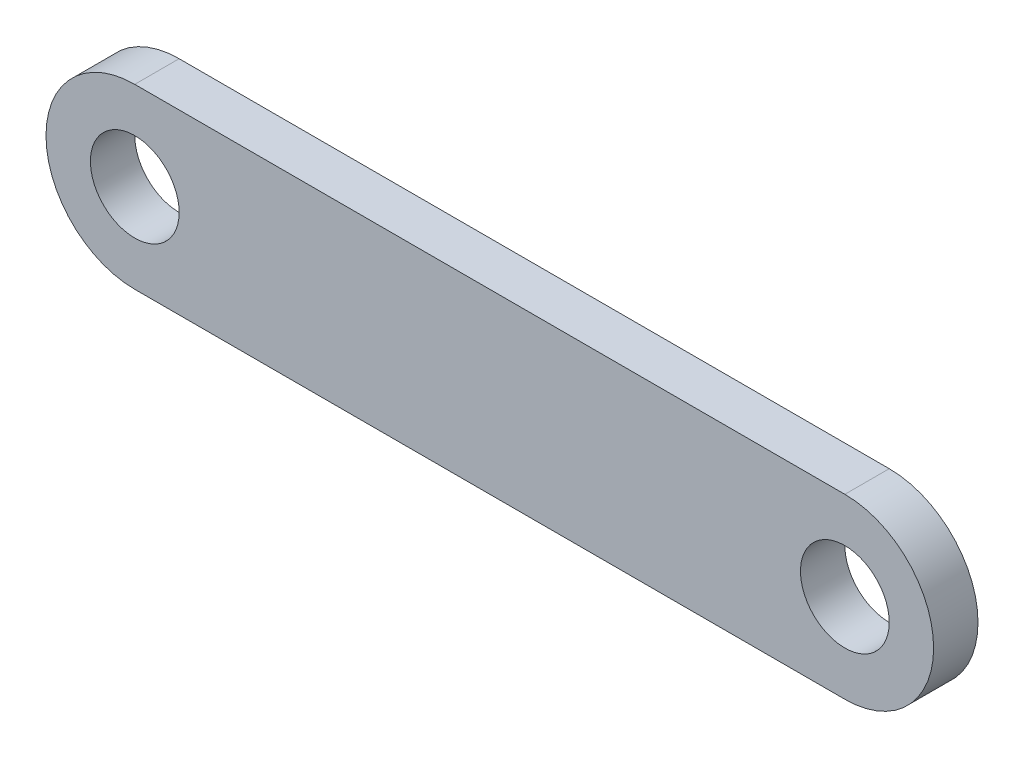
ISO-10303-21;
HEADER;
FILE_DESCRIPTION(('STEP AP214'),'2;1');
FILE_NAME('part.step','',(''),(''),'','','');
FILE_SCHEMA(('AUTOMOTIVE_DESIGN { 1 0 10303 214 1 1 1 1 }'));
ENDSEC;
DATA;
#1=APPLICATION_CONTEXT('core data for automotive mechanical design processes');
#2=APPLICATION_PROTOCOL_DEFINITION('international standard','automotive_design',2000,#1);
#3=PRODUCT_CONTEXT('',#1,'mechanical');
#4=PRODUCT('Part','Part','',(#3));
#5=PRODUCT_RELATED_PRODUCT_CATEGORY('part','',(#4));
#6=PRODUCT_DEFINITION_FORMATION('','',#4);
#7=PRODUCT_DEFINITION_CONTEXT('part definition',#1,'design');
#8=PRODUCT_DEFINITION('design','',#6,#7);
#9=PRODUCT_DEFINITION_SHAPE('','',#8);
#10=(LENGTH_UNIT() NAMED_UNIT(*) SI_UNIT(.MILLI.,.METRE.));
#11=(NAMED_UNIT(*) PLANE_ANGLE_UNIT() SI_UNIT($,.RADIAN.));
#12=(NAMED_UNIT(*) SI_UNIT($,.STERADIAN.) SOLID_ANGLE_UNIT());
#13=UNCERTAINTY_MEASURE_WITH_UNIT(LENGTH_MEASURE(1.E-05),#10,'distance_accuracy_value','');
#14=(GEOMETRIC_REPRESENTATION_CONTEXT(3) GLOBAL_UNCERTAINTY_ASSIGNED_CONTEXT((#13)) GLOBAL_UNIT_ASSIGNED_CONTEXT((#10,
#11,#12)) REPRESENTATION_CONTEXT('',''));
#15=CARTESIAN_POINT('',(0.,0.,0.));
#16=DIRECTION('',(0.,0.,1.));
#17=DIRECTION('',(1.,0.,0.));
#18=AXIS2_PLACEMENT_3D('',#15,#16,#17);
#19=CARTESIAN_POINT('',(0.,0.,3.175));
#20=DIRECTION('',(0.,0.,1.));
#21=DIRECTION('',(1.,0.,0.));
#22=AXIS2_PLACEMENT_3D('',#19,#20,#21);
#23=PLANE('',#22);
#24=CARTESIAN_POINT('',(0.,0.,3.175));
#25=DIRECTION('',(0.,0.,1.));
#26=DIRECTION('',(1.,0.,0.));
#27=AXIS2_PLACEMENT_3D('',#24,#25,#26);
#28=CIRCLE('',#27,3.175);
#29=CARTESIAN_POINT('',(3.175,0.,3.175));
#30=VERTEX_POINT('',#29);
#31=EDGE_CURVE('E99',#30,#30,#28,.T.);
#32=ORIENTED_EDGE('',*,*,#31,.F.);
#33=EDGE_LOOP('',(#32));
#34=FACE_BOUND('',#33,.T.);
#35=CARTESIAN_POINT('',(0.,0.,3.175));
#36=DIRECTION('',(0.,0.,1.));
#37=DIRECTION('',(1.,0.,0.));
#38=AXIS2_PLACEMENT_3D('',#35,#36,#37);
#39=CIRCLE('',#38,6.35);
#40=CARTESIAN_POINT('',(0.,6.35,3.175));
#41=VERTEX_POINT('',#40);
#42=CARTESIAN_POINT('',(0.,-6.35,3.175));
#43=VERTEX_POINT('',#42);
#44=EDGE_CURVE('E84',#41,#43,#39,.T.);
#45=ORIENTED_EDGE('',*,*,#44,.T.);
#46=DIRECTION('',(1.,0.,0.));
#47=VECTOR('',#46,1.);
#48=CARTESIAN_POINT('',(0.,-6.35,3.175));
#49=LINE('',#48,#47);
#50=CARTESIAN_POINT('',(50.8,-6.35,3.175));
#51=VERTEX_POINT('',#50);
#52=EDGE_CURVE('E79',#43,#51,#49,.T.);
#53=ORIENTED_EDGE('',*,*,#52,.T.);
#54=CARTESIAN_POINT('',(50.8,0.,3.175));
#55=DIRECTION('',(0.,0.,1.));
#56=DIRECTION('',(1.,0.,0.));
#57=AXIS2_PLACEMENT_3D('',#54,#55,#56);
#58=CIRCLE('',#57,6.35);
#59=CARTESIAN_POINT('',(50.8,6.35,3.175));
#60=VERTEX_POINT('',#59);
#61=EDGE_CURVE('E82',#51,#60,#58,.T.);
#62=ORIENTED_EDGE('',*,*,#61,.T.);
#63=DIRECTION('',(-1.,0.,0.));
#64=VECTOR('',#63,1.);
#65=CARTESIAN_POINT('',(0.,6.35,3.175));
#66=LINE('',#65,#64);
#67=EDGE_CURVE('E49',#60,#41,#66,.T.);
#68=ORIENTED_EDGE('',*,*,#67,.T.);
#69=EDGE_LOOP('',(#45,#53,#62,#68));
#70=FACE_BOUND('',#69,.T.);
#71=CARTESIAN_POINT('',(50.8,0.,3.175));
#72=DIRECTION('',(0.,0.,1.));
#73=DIRECTION('',(1.,0.,0.));
#74=AXIS2_PLACEMENT_3D('',#71,#72,#73);
#75=CIRCLE('',#74,3.175);
#76=CARTESIAN_POINT('',(53.975,0.,3.175));
#77=VERTEX_POINT('',#76);
#78=EDGE_CURVE('E114',#77,#77,#75,.T.);
#79=ORIENTED_EDGE('',*,*,#78,.F.);
#80=EDGE_LOOP('',(#79));
#81=FACE_BOUND('',#80,.T.);
#82=ADVANCED_FACE('F32',(#34,#70,#81),#23,.T.);
#83=CARTESIAN_POINT('',(0.,0.,0.));
#84=DIRECTION('',(0.,0.,1.));
#85=DIRECTION('',(1.,0.,0.));
#86=AXIS2_PLACEMENT_3D('',#83,#84,#85);
#87=PLANE('',#86);
#88=CARTESIAN_POINT('',(0.,0.,0.));
#89=DIRECTION('',(0.,0.,1.));
#90=DIRECTION('',(1.,0.,0.));
#91=AXIS2_PLACEMENT_3D('',#88,#89,#90);
#92=CIRCLE('',#91,3.175);
#93=CARTESIAN_POINT('',(3.175,0.,0.));
#94=VERTEX_POINT('',#93);
#95=EDGE_CURVE('E111',#94,#94,#92,.T.);
#96=ORIENTED_EDGE('',*,*,#95,.T.);
#97=EDGE_LOOP('',(#96));
#98=FACE_BOUND('',#97,.T.);
#99=CARTESIAN_POINT('',(0.,0.,0.));
#100=DIRECTION('',(0.,0.,1.));
#101=DIRECTION('',(1.,0.,0.));
#102=AXIS2_PLACEMENT_3D('',#99,#100,#101);
#103=CIRCLE('',#102,6.35);
#104=CARTESIAN_POINT('',(0.,6.35,0.));
#105=VERTEX_POINT('',#104);
#106=CARTESIAN_POINT('',(0.,-6.35,0.));
#107=VERTEX_POINT('',#106);
#108=EDGE_CURVE('E96',#105,#107,#103,.T.);
#109=ORIENTED_EDGE('',*,*,#108,.F.);
#110=DIRECTION('',(-1.,0.,0.));
#111=VECTOR('',#110,1.);
#112=CARTESIAN_POINT('',(0.,6.35,0.));
#113=LINE('',#112,#111);
#114=CARTESIAN_POINT('',(50.8,6.35,0.));
#115=VERTEX_POINT('',#114);
#116=EDGE_CURVE('E72',#115,#105,#113,.T.);
#117=ORIENTED_EDGE('',*,*,#116,.F.);
#118=CARTESIAN_POINT('',(50.8,0.,0.));
#119=DIRECTION('',(0.,0.,1.));
#120=DIRECTION('',(1.,0.,0.));
#121=AXIS2_PLACEMENT_3D('',#118,#119,#120);
#122=CIRCLE('',#121,6.35);
#123=CARTESIAN_POINT('',(50.8,-6.35,0.));
#124=VERTEX_POINT('',#123);
#125=EDGE_CURVE('E66',#124,#115,#122,.T.);
#126=ORIENTED_EDGE('',*,*,#125,.F.);
#127=DIRECTION('',(1.,0.,0.));
#128=VECTOR('',#127,1.);
#129=CARTESIAN_POINT('',(0.,-6.35,0.));
#130=LINE('',#129,#128);
#131=EDGE_CURVE('E88',#107,#124,#130,.T.);
#132=ORIENTED_EDGE('',*,*,#131,.F.);
#133=EDGE_LOOP('',(#109,#117,#126,#132));
#134=FACE_BOUND('',#133,.T.);
#135=CARTESIAN_POINT('',(50.8,0.,0.));
#136=DIRECTION('',(0.,0.,1.));
#137=DIRECTION('',(1.,0.,0.));
#138=AXIS2_PLACEMENT_3D('',#135,#136,#137);
#139=CIRCLE('',#138,3.175);
#140=CARTESIAN_POINT('',(53.975,0.,0.));
#141=VERTEX_POINT('',#140);
#142=EDGE_CURVE('E117',#141,#141,#139,.T.);
#143=ORIENTED_EDGE('',*,*,#142,.T.);
#144=EDGE_LOOP('',(#143));
#145=FACE_BOUND('',#144,.T.);
#146=ADVANCED_FACE('F107',(#98,#134,#145),#87,.F.);
#147=CARTESIAN_POINT('',(0.,0.,3.175));
#148=DIRECTION('',(0.,0.,-1.));
#149=DIRECTION('',(-1.,0.,0.));
#150=AXIS2_PLACEMENT_3D('',#147,#148,#149);
#151=CYLINDRICAL_SURFACE('',#150,6.35);
#152=ORIENTED_EDGE('',*,*,#108,.T.);
#153=DIRECTION('',(0.,0.,-1.));
#154=VECTOR('',#153,1.);
#155=CARTESIAN_POINT('',(0.,-6.35,3.175));
#156=LINE('',#155,#154);
#157=EDGE_CURVE('E11',#43,#107,#156,.T.);
#158=ORIENTED_EDGE('',*,*,#157,.F.);
#159=ORIENTED_EDGE('',*,*,#44,.F.);
#160=DIRECTION('',(0.,0.,-1.));
#161=VECTOR('',#160,1.);
#162=CARTESIAN_POINT('',(0.,6.35,3.175));
#163=LINE('',#162,#161);
#164=EDGE_CURVE('E92',#41,#105,#163,.T.);
#165=ORIENTED_EDGE('',*,*,#164,.T.);
#166=EDGE_LOOP('',(#152,#158,#159,#165));
#167=FACE_BOUND('',#166,.T.);
#168=ADVANCED_FACE('F34',(#167),#151,.T.);
#169=CARTESIAN_POINT('',(0.,-6.35,3.175));
#170=DIRECTION('',(0.,1.,0.));
#171=DIRECTION('',(0.,0.,1.));
#172=AXIS2_PLACEMENT_3D('',#169,#170,#171);
#173=PLANE('',#172);
#174=ORIENTED_EDGE('',*,*,#131,.T.);
#175=DIRECTION('',(0.,0.,-1.));
#176=VECTOR('',#175,1.);
#177=CARTESIAN_POINT('',(50.8,-6.35,3.175));
#178=LINE('',#177,#176);
#179=EDGE_CURVE('E41',#51,#124,#178,.T.);
#180=ORIENTED_EDGE('',*,*,#179,.F.);
#181=ORIENTED_EDGE('',*,*,#52,.F.);
#182=ORIENTED_EDGE('',*,*,#157,.T.);
#183=EDGE_LOOP('',(#174,#180,#181,#182));
#184=FACE_BOUND('',#183,.T.);
#185=ADVANCED_FACE('F87',(#184),#173,.F.);
#186=CARTESIAN_POINT('',(50.8,0.,3.175));
#187=DIRECTION('',(0.,0.,-1.));
#188=DIRECTION('',(-1.,0.,0.));
#189=AXIS2_PLACEMENT_3D('',#186,#187,#188);
#190=CYLINDRICAL_SURFACE('',#189,6.35);
#191=ORIENTED_EDGE('',*,*,#125,.T.);
#192=DIRECTION('',(0.,0.,-1.));
#193=VECTOR('',#192,1.);
#194=CARTESIAN_POINT('',(50.8,6.35,3.175));
#195=LINE('',#194,#193);
#196=EDGE_CURVE('E89',#60,#115,#195,.T.);
#197=ORIENTED_EDGE('',*,*,#196,.F.);
#198=ORIENTED_EDGE('',*,*,#61,.F.);
#199=ORIENTED_EDGE('',*,*,#179,.T.);
#200=EDGE_LOOP('',(#191,#197,#198,#199));
#201=FACE_BOUND('',#200,.T.);
#202=ADVANCED_FACE('F90',(#201),#190,.T.);
#203=CARTESIAN_POINT('',(0.,6.35,3.175));
#204=DIRECTION('',(0.,-1.,0.));
#205=DIRECTION('',(0.,0.,-1.));
#206=AXIS2_PLACEMENT_3D('',#203,#204,#205);
#207=PLANE('',#206);
#208=ORIENTED_EDGE('',*,*,#116,.T.);
#209=ORIENTED_EDGE('',*,*,#164,.F.);
#210=ORIENTED_EDGE('',*,*,#67,.F.);
#211=ORIENTED_EDGE('',*,*,#196,.T.);
#212=EDGE_LOOP('',(#208,#209,#210,#211));
#213=FACE_BOUND('',#212,.T.);
#214=ADVANCED_FACE('F104',(#213),#207,.F.);
#215=CARTESIAN_POINT('',(0.,0.,3.175));
#216=DIRECTION('',(0.,0.,-1.));
#217=DIRECTION('',(-1.,0.,0.));
#218=AXIS2_PLACEMENT_3D('',#215,#216,#217);
#219=CYLINDRICAL_SURFACE('',#218,3.175);
#220=ORIENTED_EDGE('',*,*,#31,.T.);
#221=EDGE_LOOP('',(#220));
#222=FACE_BOUND('',#221,.T.);
#223=ORIENTED_EDGE('',*,*,#95,.F.);
#224=EDGE_LOOP('',(#223));
#225=FACE_BOUND('',#224,.T.);
#226=ADVANCED_FACE('F135',(#222,#225),#219,.F.);
#227=CARTESIAN_POINT('',(50.8,0.,3.175));
#228=DIRECTION('',(0.,0.,-1.));
#229=DIRECTION('',(-1.,0.,0.));
#230=AXIS2_PLACEMENT_3D('',#227,#228,#229);
#231=CYLINDRICAL_SURFACE('',#230,3.175);
#232=ORIENTED_EDGE('',*,*,#78,.T.);
#233=EDGE_LOOP('',(#232));
#234=FACE_BOUND('',#233,.T.);
#235=ORIENTED_EDGE('',*,*,#142,.F.);
#236=EDGE_LOOP('',(#235));
#237=FACE_BOUND('',#236,.T.);
#238=ADVANCED_FACE('F123',(#234,#237),#231,.F.);
#239=CLOSED_SHELL('',(#82,#146,#168,#185,#202,#214,#226,#238));
#240=MANIFOLD_SOLID_BREP('B2',#239);
#241=ADVANCED_BREP_SHAPE_REPRESENTATION('',(#18,#240),#14);
#242=SHAPE_DEFINITION_REPRESENTATION(#9,#241);
ENDSEC;
END-ISO-10303-21;
